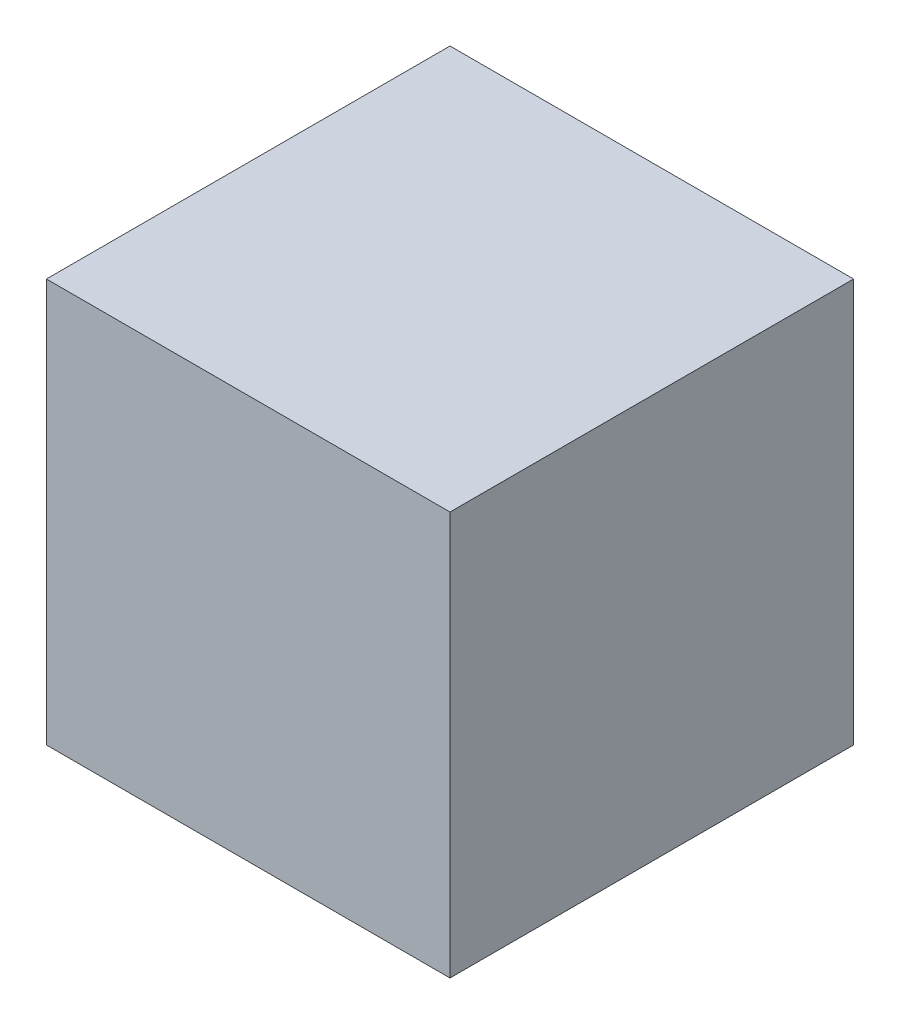
ISO-10303-21;
HEADER;
FILE_DESCRIPTION(('STEP AP214'),'2;1');
FILE_NAME('part.step','',(''),(''),'','','');
FILE_SCHEMA(('AUTOMOTIVE_DESIGN { 1 0 10303 214 1 1 1 1 }'));
ENDSEC;
DATA;
#1=APPLICATION_CONTEXT('core data for automotive mechanical design processes');
#2=APPLICATION_PROTOCOL_DEFINITION('international standard','automotive_design',2000,#1);
#3=PRODUCT_CONTEXT('',#1,'mechanical');
#4=PRODUCT('Part','Part','',(#3));
#5=PRODUCT_RELATED_PRODUCT_CATEGORY('part','',(#4));
#6=PRODUCT_DEFINITION_FORMATION('','',#4);
#7=PRODUCT_DEFINITION_CONTEXT('part definition',#1,'design');
#8=PRODUCT_DEFINITION('design','',#6,#7);
#9=PRODUCT_DEFINITION_SHAPE('','',#8);
#10=(LENGTH_UNIT() NAMED_UNIT(*) SI_UNIT(.MILLI.,.METRE.));
#11=(NAMED_UNIT(*) PLANE_ANGLE_UNIT() SI_UNIT($,.RADIAN.));
#12=(NAMED_UNIT(*) SI_UNIT($,.STERADIAN.) SOLID_ANGLE_UNIT());
#13=UNCERTAINTY_MEASURE_WITH_UNIT(LENGTH_MEASURE(1.E-05),#10,'distance_accuracy_value','');
#14=(GEOMETRIC_REPRESENTATION_CONTEXT(3) GLOBAL_UNCERTAINTY_ASSIGNED_CONTEXT((#13)) GLOBAL_UNIT_ASSIGNED_CONTEXT((#10,
#11,#12)) REPRESENTATION_CONTEXT('',''));
#15=CARTESIAN_POINT('',(0.,0.,0.));
#16=DIRECTION('',(0.,0.,1.));
#17=DIRECTION('',(1.,0.,0.));
#18=AXIS2_PLACEMENT_3D('',#15,#16,#17);
#19=CARTESIAN_POINT('',(0.499999999999997,0.5,0.500000000000004));
#20=DIRECTION('',(-1.,0.,0.));
#21=DIRECTION('',(0.,0.,1.));
#22=AXIS2_PLACEMENT_3D('',#19,#20,#21);
#23=PLANE('',#22);
#24=DIRECTION('',(0.,0.,-1.));
#25=VECTOR('',#24,1.);
#26=CARTESIAN_POINT('',(0.499999999999997,-0.5,0.500000000000004));
#27=LINE('',#26,#25);
#28=CARTESIAN_POINT('',(0.499999999999997,-0.5,0.500000000000004));
#29=VERTEX_POINT('',#28);
#30=CARTESIAN_POINT('',(0.499999999999997,-0.5,-0.499999999999997));
#31=VERTEX_POINT('',#30);
#32=EDGE_CURVE('E98',#29,#31,#27,.T.);
#33=ORIENTED_EDGE('',*,*,#32,.T.);
#34=DIRECTION('',(0.,-1.,0.));
#35=VECTOR('',#34,1.);
#36=CARTESIAN_POINT('',(0.499999999999997,0.5,-0.499999999999997));
#37=LINE('',#36,#35);
#38=CARTESIAN_POINT('',(0.499999999999997,0.5,-0.499999999999997));
#39=VERTEX_POINT('',#38);
#40=EDGE_CURVE('E11',#39,#31,#37,.T.);
#41=ORIENTED_EDGE('',*,*,#40,.F.);
#42=DIRECTION('',(0.,0.,-1.));
#43=VECTOR('',#42,1.);
#44=CARTESIAN_POINT('',(0.499999999999997,0.5,0.500000000000004));
#45=LINE('',#44,#43);
#46=CARTESIAN_POINT('',(0.499999999999997,0.5,0.500000000000004));
#47=VERTEX_POINT('',#46);
#48=EDGE_CURVE('E86',#47,#39,#45,.T.);
#49=ORIENTED_EDGE('',*,*,#48,.F.);
#50=DIRECTION('',(0.,-1.,0.));
#51=VECTOR('',#50,1.);
#52=CARTESIAN_POINT('',(0.499999999999997,0.5,0.500000000000004));
#53=LINE('',#52,#51);
#54=EDGE_CURVE('E94',#47,#29,#53,.T.);
#55=ORIENTED_EDGE('',*,*,#54,.T.);
#56=EDGE_LOOP('',(#33,#41,#49,#55));
#57=FACE_BOUND('',#56,.T.);
#58=ADVANCED_FACE('F35',(#57),#23,.F.);
#59=CARTESIAN_POINT('',(-0.500000000000004,0.5,-0.499999999999997));
#60=DIRECTION('',(0.,0.,1.));
#61=DIRECTION('',(1.,0.,0.));
#62=AXIS2_PLACEMENT_3D('',#59,#60,#61);
#63=PLANE('',#62);
#64=DIRECTION('',(-1.,0.,0.));
#65=VECTOR('',#64,1.);
#66=CARTESIAN_POINT('',(-0.500000000000004,-0.5,-0.499999999999997));
#67=LINE('',#66,#65);
#68=CARTESIAN_POINT('',(-0.500000000000004,-0.5,-0.499999999999997));
#69=VERTEX_POINT('',#68);
#70=EDGE_CURVE('E90',#31,#69,#67,.T.);
#71=ORIENTED_EDGE('',*,*,#70,.T.);
#72=DIRECTION('',(0.,-1.,0.));
#73=VECTOR('',#72,1.);
#74=CARTESIAN_POINT('',(-0.500000000000004,0.5,-0.499999999999997));
#75=LINE('',#74,#73);
#76=CARTESIAN_POINT('',(-0.500000000000004,0.5,-0.499999999999997));
#77=VERTEX_POINT('',#76);
#78=EDGE_CURVE('E43',#77,#69,#75,.T.);
#79=ORIENTED_EDGE('',*,*,#78,.F.);
#80=DIRECTION('',(-1.,0.,0.));
#81=VECTOR('',#80,1.);
#82=CARTESIAN_POINT('',(-0.500000000000004,0.5,-0.499999999999997));
#83=LINE('',#82,#81);
#84=EDGE_CURVE('E81',#39,#77,#83,.T.);
#85=ORIENTED_EDGE('',*,*,#84,.F.);
#86=ORIENTED_EDGE('',*,*,#40,.T.);
#87=EDGE_LOOP('',(#71,#79,#85,#86));
#88=FACE_BOUND('',#87,.T.);
#89=ADVANCED_FACE('F89',(#88),#63,.F.);
#90=CARTESIAN_POINT('',(-0.500000000000004,0.5,0.500000000000004));
#91=DIRECTION('',(1.,0.,0.));
#92=DIRECTION('',(0.,0.,-1.));
#93=AXIS2_PLACEMENT_3D('',#90,#91,#92);
#94=PLANE('',#93);
#95=DIRECTION('',(0.,0.,1.));
#96=VECTOR('',#95,1.);
#97=CARTESIAN_POINT('',(-0.500000000000004,-0.5,0.500000000000004));
#98=LINE('',#97,#96);
#99=CARTESIAN_POINT('',(-0.500000000000004,-0.5,0.500000000000004));
#100=VERTEX_POINT('',#99);
#101=EDGE_CURVE('E68',#69,#100,#98,.T.);
#102=ORIENTED_EDGE('',*,*,#101,.T.);
#103=DIRECTION('',(0.,-1.,0.));
#104=VECTOR('',#103,1.);
#105=CARTESIAN_POINT('',(-0.500000000000004,0.5,0.500000000000004));
#106=LINE('',#105,#104);
#107=CARTESIAN_POINT('',(-0.500000000000004,0.5,0.500000000000004));
#108=VERTEX_POINT('',#107);
#109=EDGE_CURVE('E91',#108,#100,#106,.T.);
#110=ORIENTED_EDGE('',*,*,#109,.F.);
#111=DIRECTION('',(0.,0.,1.));
#112=VECTOR('',#111,1.);
#113=CARTESIAN_POINT('',(-0.500000000000004,0.5,0.500000000000004));
#114=LINE('',#113,#112);
#115=EDGE_CURVE('E84',#77,#108,#114,.T.);
#116=ORIENTED_EDGE('',*,*,#115,.F.);
#117=ORIENTED_EDGE('',*,*,#78,.T.);
#118=EDGE_LOOP('',(#102,#110,#116,#117));
#119=FACE_BOUND('',#118,.T.);
#120=ADVANCED_FACE('F92',(#119),#94,.F.);
#121=CARTESIAN_POINT('',(-0.500000000000004,0.5,0.500000000000004));
#122=DIRECTION('',(0.,0.,-1.));
#123=DIRECTION('',(-1.,0.,0.));
#124=AXIS2_PLACEMENT_3D('',#121,#122,#123);
#125=PLANE('',#124);
#126=DIRECTION('',(1.,0.,0.));
#127=VECTOR('',#126,1.);
#128=CARTESIAN_POINT('',(-0.500000000000004,-0.5,0.500000000000004));
#129=LINE('',#128,#127);
#130=EDGE_CURVE('E74',#100,#29,#129,.T.);
#131=ORIENTED_EDGE('',*,*,#130,.T.);
#132=ORIENTED_EDGE('',*,*,#54,.F.);
#133=DIRECTION('',(1.,0.,0.));
#134=VECTOR('',#133,1.);
#135=CARTESIAN_POINT('',(-0.500000000000004,0.5,0.500000000000004));
#136=LINE('',#135,#134);
#137=EDGE_CURVE('E51',#108,#47,#136,.T.);
#138=ORIENTED_EDGE('',*,*,#137,.F.);
#139=ORIENTED_EDGE('',*,*,#109,.T.);
#140=EDGE_LOOP('',(#131,#132,#138,#139));
#141=FACE_BOUND('',#140,.T.);
#142=ADVANCED_FACE('F105',(#141),#125,.F.);
#143=CARTESIAN_POINT('',(0.,0.5,0.));
#144=DIRECTION('',(0.,-1.,0.));
#145=DIRECTION('',(0.,0.,-1.));
#146=AXIS2_PLACEMENT_3D('',#143,#144,#145);
#147=PLANE('',#146);
#148=ORIENTED_EDGE('',*,*,#48,.T.);
#149=ORIENTED_EDGE('',*,*,#84,.T.);
#150=ORIENTED_EDGE('',*,*,#115,.T.);
#151=ORIENTED_EDGE('',*,*,#137,.T.);
#152=EDGE_LOOP('',(#148,#149,#150,#151));
#153=FACE_BOUND('',#152,.T.);
#154=ADVANCED_FACE('F82',(#153),#147,.F.);
#155=CARTESIAN_POINT('',(0.,-0.5,0.));
#156=DIRECTION('',(0.,-1.,0.));
#157=DIRECTION('',(0.,0.,-1.));
#158=AXIS2_PLACEMENT_3D('',#155,#156,#157);
#159=PLANE('',#158);
#160=ORIENTED_EDGE('',*,*,#32,.F.);
#161=ORIENTED_EDGE('',*,*,#130,.F.);
#162=ORIENTED_EDGE('',*,*,#101,.F.);
#163=ORIENTED_EDGE('',*,*,#70,.F.);
#164=EDGE_LOOP('',(#160,#161,#162,#163));
#165=FACE_BOUND('',#164,.T.);
#166=ADVANCED_FACE('F108',(#165),#159,.T.);
#167=CLOSED_SHELL('',(#58,#89,#120,#142,#154,#166));
#168=MANIFOLD_SOLID_BREP('B2',#167);
#169=ADVANCED_BREP_SHAPE_REPRESENTATION('',(#18,#168),#14);
#170=SHAPE_DEFINITION_REPRESENTATION(#9,#169);
ENDSEC;
END-ISO-10303-21;
